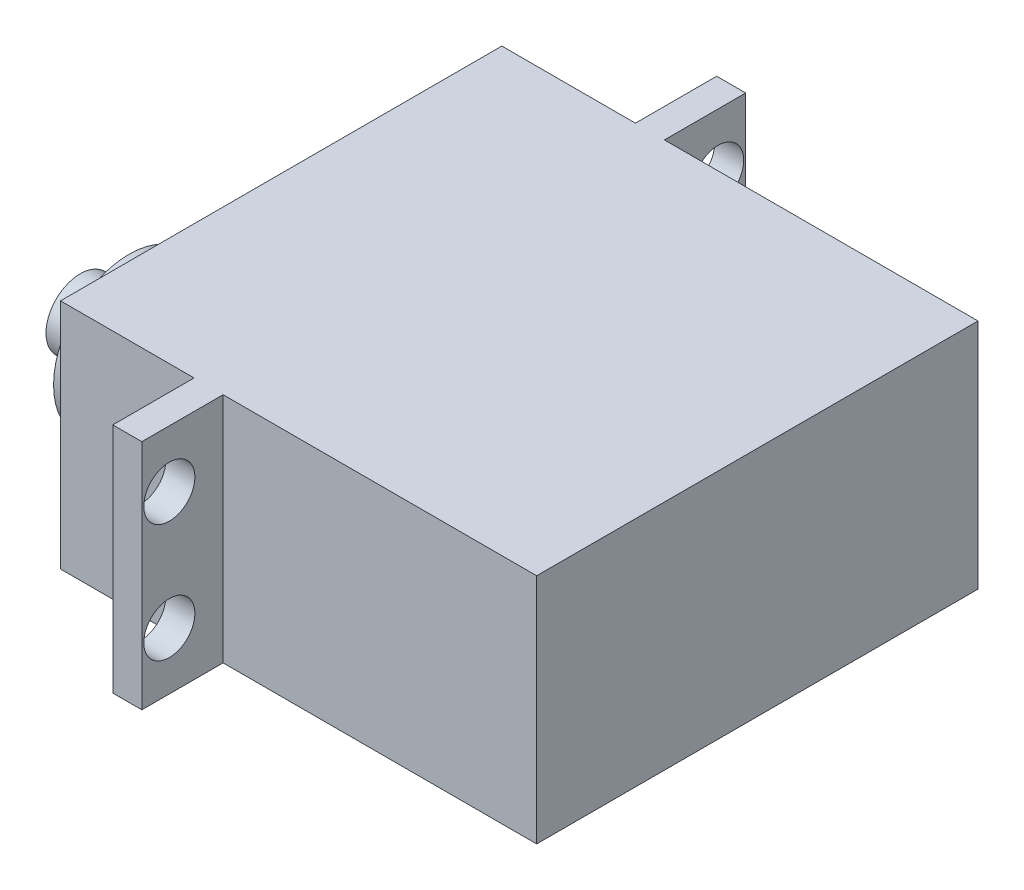
ISO-10303-21;
HEADER;
FILE_DESCRIPTION(('STEP AP214'),'2;1');
FILE_NAME('part.step','',(''),(''),'','','');
FILE_SCHEMA(('AUTOMOTIVE_DESIGN { 1 0 10303 214 1 1 1 1 }'));
ENDSEC;
DATA;
#1=APPLICATION_CONTEXT('core data for automotive mechanical design processes');
#2=APPLICATION_PROTOCOL_DEFINITION('international standard','automotive_design',2000,#1);
#3=PRODUCT_CONTEXT('',#1,'mechanical');
#4=PRODUCT('Part','Part','',(#3));
#5=PRODUCT_RELATED_PRODUCT_CATEGORY('part','',(#4));
#6=PRODUCT_DEFINITION_FORMATION('','',#4);
#7=PRODUCT_DEFINITION_CONTEXT('part definition',#1,'design');
#8=PRODUCT_DEFINITION('design','',#6,#7);
#9=PRODUCT_DEFINITION_SHAPE('','',#8);
#10=(LENGTH_UNIT() NAMED_UNIT(*) SI_UNIT(.MILLI.,.METRE.));
#11=(NAMED_UNIT(*) PLANE_ANGLE_UNIT() SI_UNIT($,.RADIAN.));
#12=(NAMED_UNIT(*) SI_UNIT($,.STERADIAN.) SOLID_ANGLE_UNIT());
#13=UNCERTAINTY_MEASURE_WITH_UNIT(LENGTH_MEASURE(1.E-05),#10,'distance_accuracy_value','');
#14=(GEOMETRIC_REPRESENTATION_CONTEXT(3) GLOBAL_UNCERTAINTY_ASSIGNED_CONTEXT((#13)) GLOBAL_UNIT_ASSIGNED_CONTEXT((#10,
#11,#12)) REPRESENTATION_CONTEXT('',''));
#15=CARTESIAN_POINT('',(0.,0.,0.));
#16=DIRECTION('',(0.,0.,1.));
#17=DIRECTION('',(1.,0.,0.));
#18=AXIS2_PLACEMENT_3D('',#15,#16,#17);
#19=CARTESIAN_POINT('',(-23.8201989820812,0.,28.3));
#20=DIRECTION('',(-1.,0.,0.));
#21=DIRECTION('',(0.,0.,1.));
#22=AXIS2_PLACEMENT_3D('',#19,#20,#21);
#23=PLANE('',#22);
#24=CARTESIAN_POINT('',(-23.8201989820812,0.,28.3));
#25=DIRECTION('',(-1.,0.,0.));
#26=DIRECTION('',(0.,0.,1.));
#27=AXIS2_PLACEMENT_3D('',#24,#25,#26);
#28=CIRCLE('',#27,6.5);
#29=CARTESIAN_POINT('',(-23.8201989820812,0.,34.8));
#30=VERTEX_POINT('',#29);
#31=EDGE_CURVE('E133',#30,#30,#28,.T.);
#32=ORIENTED_EDGE('',*,*,#31,.T.);
#33=EDGE_LOOP('',(#32));
#34=FACE_BOUND('',#33,.T.);
#35=CARTESIAN_POINT('',(-23.8201989820812,0.,28.3));
#36=DIRECTION('',(-1.,0.,0.));
#37=DIRECTION('',(0.,0.,1.));
#38=AXIS2_PLACEMENT_3D('',#35,#36,#37);
#39=CIRCLE('',#38,2.95);
#40=CARTESIAN_POINT('',(-23.8201989820812,0.,31.25));
#41=VERTEX_POINT('',#40);
#42=EDGE_CURVE('E209',#41,#41,#39,.T.);
#43=ORIENTED_EDGE('',*,*,#42,.F.);
#44=EDGE_LOOP('',(#43));
#45=FACE_BOUND('',#44,.T.);
#46=ADVANCED_FACE('F30',(#34,#45),#23,.T.);
#47=CARTESIAN_POINT('',(-20.0201989820812,9.77558057072201,38.));
#48=DIRECTION('',(1.,0.,0.));
#49=DIRECTION('',(0.,0.,-1.));
#50=AXIS2_PLACEMENT_3D('',#47,#48,#49);
#51=PLANE('',#50);
#52=DIRECTION('',(0.,-1.,0.));
#53=VECTOR('',#52,1.);
#54=CARTESIAN_POINT('',(-20.0201989820812,9.77558057072201,0.));
#55=LINE('',#54,#53);
#56=CARTESIAN_POINT('',(-20.0201989820812,9.77558057072201,0.));
#57=VERTEX_POINT('',#56);
#58=CARTESIAN_POINT('',(-20.0201989820812,-10.224419429278,0.));
#59=VERTEX_POINT('',#58);
#60=EDGE_CURVE('E170',#57,#59,#55,.T.);
#61=ORIENTED_EDGE('',*,*,#60,.T.);
#62=DIRECTION('',(0.,0.,-1.));
#63=VECTOR('',#62,1.);
#64=CARTESIAN_POINT('',(-20.0201989820812,-10.224419429278,38.));
#65=LINE('',#64,#63);
#66=CARTESIAN_POINT('',(-20.0201989820812,-10.224419429278,38.));
#67=VERTEX_POINT('',#66);
#68=EDGE_CURVE('E200',#67,#59,#65,.T.);
#69=ORIENTED_EDGE('',*,*,#68,.F.);
#70=DIRECTION('',(0.,-1.,0.));
#71=VECTOR('',#70,1.);
#72=CARTESIAN_POINT('',(-20.0201989820812,9.77558057072201,38.));
#73=LINE('',#72,#71);
#74=CARTESIAN_POINT('',(-20.0201989820812,9.77558057072201,38.));
#75=VERTEX_POINT('',#74);
#76=EDGE_CURVE('E171',#75,#67,#73,.T.);
#77=ORIENTED_EDGE('',*,*,#76,.F.);
#78=DIRECTION('',(0.,0.,-1.));
#79=VECTOR('',#78,1.);
#80=CARTESIAN_POINT('',(-20.0201989820812,9.77558057072201,38.));
#81=LINE('',#80,#79);
#82=EDGE_CURVE('E181',#75,#57,#81,.T.);
#83=ORIENTED_EDGE('',*,*,#82,.T.);
#84=EDGE_LOOP('',(#61,#69,#77,#83));
#85=FACE_BOUND('',#84,.T.);
#86=CARTESIAN_POINT('',(-20.0201989820812,0.,28.3));
#87=DIRECTION('',(1.,0.,0.));
#88=DIRECTION('',(0.,0.,-1.));
#89=AXIS2_PLACEMENT_3D('',#86,#87,#88);
#90=CIRCLE('',#89,6.5);
#91=CARTESIAN_POINT('',(-20.0201989820812,0.,21.8));
#92=VERTEX_POINT('',#91);
#93=EDGE_CURVE('E11',#92,#92,#90,.F.);
#94=ORIENTED_EDGE('',*,*,#93,.F.);
#95=EDGE_LOOP('',(#94));
#96=FACE_BOUND('',#95,.T.);
#97=ADVANCED_FACE('F32',(#85,#96),#51,.F.);
#98=CARTESIAN_POINT('',(-20.0201989820812,-10.224419429278,38.));
#99=DIRECTION('',(0.,0.,1.));
#100=DIRECTION('',(1.,0.,0.));
#101=AXIS2_PLACEMENT_3D('',#98,#99,#100);
#102=PLANE('',#101);
#103=DIRECTION('',(0.,-1.,0.));
#104=VECTOR('',#103,1.);
#105=CARTESIAN_POINT('',(-8.52019898208117,-10.224419429278,38.));
#106=LINE('',#105,#104);
#107=CARTESIAN_POINT('',(-8.52019898208118,9.77558057072201,38.));
#108=VERTEX_POINT('',#107);
#109=CARTESIAN_POINT('',(-8.52019898208118,-10.224419429278,38.));
#110=VERTEX_POINT('',#109);
#111=EDGE_CURVE('E47',#108,#110,#106,.T.);
#112=ORIENTED_EDGE('',*,*,#111,.F.);
#113=DIRECTION('',(-1.,0.,0.));
#114=VECTOR('',#113,1.);
#115=CARTESIAN_POINT('',(-20.0201989820812,9.77558057072201,38.));
#116=LINE('',#115,#114);
#117=EDGE_CURVE('E130',#108,#75,#116,.T.);
#118=ORIENTED_EDGE('',*,*,#117,.T.);
#119=ORIENTED_EDGE('',*,*,#76,.T.);
#120=DIRECTION('',(1.,0.,0.));
#121=VECTOR('',#120,1.);
#122=CARTESIAN_POINT('',(-20.0201989820812,-10.224419429278,38.));
#123=LINE('',#122,#121);
#124=EDGE_CURVE('E176',#67,#110,#123,.T.);
#125=ORIENTED_EDGE('',*,*,#124,.T.);
#126=EDGE_LOOP('',(#112,#118,#119,#125));
#127=FACE_BOUND('',#126,.T.);
#128=ADVANCED_FACE('F269',(#127),#102,.T.);
#129=CARTESIAN_POINT('',(-20.0201989820812,-10.224419429278,0.));
#130=DIRECTION('',(0.,0.,1.));
#131=DIRECTION('',(1.,0.,0.));
#132=AXIS2_PLACEMENT_3D('',#129,#130,#131);
#133=PLANE('',#132);
#134=DIRECTION('',(-1.,0.,0.));
#135=VECTOR('',#134,1.);
#136=CARTESIAN_POINT('',(-20.0201989820812,9.77558057072201,0.));
#137=LINE('',#136,#135);
#138=CARTESIAN_POINT('',(-8.52019898208118,9.77558057072201,0.));
#139=VERTEX_POINT('',#138);
#140=EDGE_CURVE('E190',#139,#57,#137,.T.);
#141=ORIENTED_EDGE('',*,*,#140,.F.);
#142=DIRECTION('',(0.,-1.,0.));
#143=VECTOR('',#142,1.);
#144=CARTESIAN_POINT('',(-8.52019898208118,-10.224419429278,0.));
#145=LINE('',#144,#143);
#146=CARTESIAN_POINT('',(-8.52019898208118,-10.224419429278,0.));
#147=VERTEX_POINT('',#146);
#148=EDGE_CURVE('E39',#139,#147,#145,.T.);
#149=ORIENTED_EDGE('',*,*,#148,.T.);
#150=DIRECTION('',(1.,0.,0.));
#151=VECTOR('',#150,1.);
#152=CARTESIAN_POINT('',(-20.0201989820812,-10.224419429278,0.));
#153=LINE('',#152,#151);
#154=EDGE_CURVE('E185',#59,#147,#153,.T.);
#155=ORIENTED_EDGE('',*,*,#154,.F.);
#156=ORIENTED_EDGE('',*,*,#60,.F.);
#157=EDGE_LOOP('',(#141,#149,#155,#156));
#158=FACE_BOUND('',#157,.T.);
#159=ADVANCED_FACE('F262',(#158),#133,.F.);
#160=CARTESIAN_POINT('',(-20.0201989820812,-10.224419429278,38.));
#161=DIRECTION('',(0.,1.,0.));
#162=DIRECTION('',(0.,0.,1.));
#163=AXIS2_PLACEMENT_3D('',#160,#161,#162);
#164=PLANE('',#163);
#165=CARTESIAN_POINT('',(-6.02019898208118,-10.224419429278,38.));
#166=VERTEX_POINT('',#165);
#167=CARTESIAN_POINT('',(20.9798010179188,-10.224419429278,38.));
#168=VERTEX_POINT('',#167);
#169=EDGE_CURVE('E174',#166,#168,#123,.T.);
#170=ORIENTED_EDGE('',*,*,#169,.F.);
#171=DIRECTION('',(0.,0.,1.));
#172=VECTOR('',#171,1.);
#173=CARTESIAN_POINT('',(-6.02019898208118,-10.224419429278,-7.));
#174=LINE('',#173,#172);
#175=CARTESIAN_POINT('',(-6.02019898208117,-10.224419429278,45.));
#176=VERTEX_POINT('',#175);
#177=EDGE_CURVE('E160',#166,#176,#174,.T.);
#178=ORIENTED_EDGE('',*,*,#177,.T.);
#179=DIRECTION('',(-1.,0.,0.));
#180=VECTOR('',#179,1.);
#181=CARTESIAN_POINT('',(-8.52019898208117,-10.224419429278,45.));
#182=LINE('',#181,#180);
#183=CARTESIAN_POINT('',(-8.52019898208117,-10.224419429278,45.));
#184=VERTEX_POINT('',#183);
#185=EDGE_CURVE('E165',#176,#184,#182,.T.);
#186=ORIENTED_EDGE('',*,*,#185,.T.);
#187=DIRECTION('',(0.,0.,-1.));
#188=VECTOR('',#187,1.);
#189=CARTESIAN_POINT('',(-8.52019898208118,-10.224419429278,-7.));
#190=LINE('',#189,#188);
#191=EDGE_CURVE('E140',#184,#110,#190,.T.);
#192=ORIENTED_EDGE('',*,*,#191,.T.);
#193=ORIENTED_EDGE('',*,*,#124,.F.);
#194=ORIENTED_EDGE('',*,*,#68,.T.);
#195=ORIENTED_EDGE('',*,*,#154,.T.);
#196=CARTESIAN_POINT('',(-8.52019898208118,-10.224419429278,-7.));
#197=VERTEX_POINT('',#196);
#198=EDGE_CURVE('E232',#147,#197,#190,.T.);
#199=ORIENTED_EDGE('',*,*,#198,.T.);
#200=DIRECTION('',(1.,0.,0.));
#201=VECTOR('',#200,1.);
#202=CARTESIAN_POINT('',(-8.52019898208118,-10.224419429278,-7.));
#203=LINE('',#202,#201);
#204=CARTESIAN_POINT('',(-6.02019898208118,-10.224419429278,-7.));
#205=VERTEX_POINT('',#204);
#206=EDGE_CURVE('E231',#197,#205,#203,.T.);
#207=ORIENTED_EDGE('',*,*,#206,.T.);
#208=CARTESIAN_POINT('',(-6.02019898208117,-10.224419429278,0.));
#209=VERTEX_POINT('',#208);
#210=EDGE_CURVE('E229',#205,#209,#174,.T.);
#211=ORIENTED_EDGE('',*,*,#210,.T.);
#212=CARTESIAN_POINT('',(20.9798010179188,-10.224419429278,0.));
#213=VERTEX_POINT('',#212);
#214=EDGE_CURVE('E184',#209,#213,#153,.T.);
#215=ORIENTED_EDGE('',*,*,#214,.T.);
#216=DIRECTION('',(0.,0.,-1.));
#217=VECTOR('',#216,1.);
#218=CARTESIAN_POINT('',(20.9798010179188,-10.224419429278,38.));
#219=LINE('',#218,#217);
#220=EDGE_CURVE('E197',#168,#213,#219,.T.);
#221=ORIENTED_EDGE('',*,*,#220,.F.);
#222=EDGE_LOOP('',(#170,#178,#186,#192,#193,#194,#195,#199,#207,#211,#215,#221));
#223=FACE_BOUND('',#222,.T.);
#224=ADVANCED_FACE('F235',(#223),#164,.F.);
#225=CARTESIAN_POINT('',(20.9798010179188,9.77558057072201,38.));
#226=DIRECTION('',(-1.,0.,0.));
#227=DIRECTION('',(0.,0.,1.));
#228=AXIS2_PLACEMENT_3D('',#225,#226,#227);
#229=PLANE('',#228);
#230=DIRECTION('',(0.,1.,0.));
#231=VECTOR('',#230,1.);
#232=CARTESIAN_POINT('',(20.9798010179188,9.77558057072201,0.));
#233=LINE('',#232,#231);
#234=CARTESIAN_POINT('',(20.9798010179188,9.77558057072201,0.));
#235=VERTEX_POINT('',#234);
#236=EDGE_CURVE('E188',#213,#235,#233,.T.);
#237=ORIENTED_EDGE('',*,*,#236,.T.);
#238=DIRECTION('',(0.,0.,-1.));
#239=VECTOR('',#238,1.);
#240=CARTESIAN_POINT('',(20.9798010179188,9.77558057072201,38.));
#241=LINE('',#240,#239);
#242=CARTESIAN_POINT('',(20.9798010179188,9.77558057072201,38.));
#243=VERTEX_POINT('',#242);
#244=EDGE_CURVE('E194',#243,#235,#241,.T.);
#245=ORIENTED_EDGE('',*,*,#244,.F.);
#246=DIRECTION('',(0.,1.,0.));
#247=VECTOR('',#246,1.);
#248=CARTESIAN_POINT('',(20.9798010179188,9.77558057072201,38.));
#249=LINE('',#248,#247);
#250=EDGE_CURVE('E178',#168,#243,#249,.T.);
#251=ORIENTED_EDGE('',*,*,#250,.F.);
#252=ORIENTED_EDGE('',*,*,#220,.T.);
#253=EDGE_LOOP('',(#237,#245,#251,#252));
#254=FACE_BOUND('',#253,.T.);
#255=ADVANCED_FACE('F256',(#254),#229,.F.);
#256=CARTESIAN_POINT('',(-20.0201989820812,9.77558057072201,38.));
#257=DIRECTION('',(0.,-1.,0.));
#258=DIRECTION('',(0.,0.,-1.));
#259=AXIS2_PLACEMENT_3D('',#256,#257,#258);
#260=PLANE('',#259);
#261=CARTESIAN_POINT('',(-6.02019898208118,9.77558057072201,0.));
#262=VERTEX_POINT('',#261);
#263=EDGE_CURVE('E175',#235,#262,#137,.T.);
#264=ORIENTED_EDGE('',*,*,#263,.T.);
#265=DIRECTION('',(0.,0.,-1.));
#266=VECTOR('',#265,1.);
#267=CARTESIAN_POINT('',(-6.02019898208118,9.77558057072201,-7.));
#268=LINE('',#267,#266);
#269=CARTESIAN_POINT('',(-6.02019898208118,9.77558057072201,-7.));
#270=VERTEX_POINT('',#269);
#271=EDGE_CURVE('E149',#262,#270,#268,.T.);
#272=ORIENTED_EDGE('',*,*,#271,.T.);
#273=DIRECTION('',(-1.,0.,0.));
#274=VECTOR('',#273,1.);
#275=CARTESIAN_POINT('',(-8.52019898208118,9.77558057072201,-7.));
#276=LINE('',#275,#274);
#277=CARTESIAN_POINT('',(-8.52019898208118,9.77558057072201,-7.));
#278=VERTEX_POINT('',#277);
#279=EDGE_CURVE('E144',#270,#278,#276,.T.);
#280=ORIENTED_EDGE('',*,*,#279,.T.);
#281=DIRECTION('',(0.,0.,1.));
#282=VECTOR('',#281,1.);
#283=CARTESIAN_POINT('',(-8.52019898208118,9.77558057072201,-7.));
#284=LINE('',#283,#282);
#285=EDGE_CURVE('E132',#278,#139,#284,.T.);
#286=ORIENTED_EDGE('',*,*,#285,.T.);
#287=ORIENTED_EDGE('',*,*,#140,.T.);
#288=ORIENTED_EDGE('',*,*,#82,.F.);
#289=ORIENTED_EDGE('',*,*,#117,.F.);
#290=CARTESIAN_POINT('',(-8.52019898208117,9.77558057072201,45.));
#291=VERTEX_POINT('',#290);
#292=EDGE_CURVE('E122',#108,#291,#284,.T.);
#293=ORIENTED_EDGE('',*,*,#292,.T.);
#294=DIRECTION('',(1.,0.,0.));
#295=VECTOR('',#294,1.);
#296=CARTESIAN_POINT('',(-8.52019898208117,9.77558057072201,45.));
#297=LINE('',#296,#295);
#298=CARTESIAN_POINT('',(-6.02019898208117,9.77558057072201,45.));
#299=VERTEX_POINT('',#298);
#300=EDGE_CURVE('E128',#291,#299,#297,.T.);
#301=ORIENTED_EDGE('',*,*,#300,.T.);
#302=CARTESIAN_POINT('',(-6.02019898208117,9.77558057072201,38.));
#303=VERTEX_POINT('',#302);
#304=EDGE_CURVE('E151',#299,#303,#268,.T.);
#305=ORIENTED_EDGE('',*,*,#304,.T.);
#306=EDGE_CURVE('E55',#243,#303,#116,.T.);
#307=ORIENTED_EDGE('',*,*,#306,.F.);
#308=ORIENTED_EDGE('',*,*,#244,.T.);
#309=EDGE_LOOP('',(#264,#272,#280,#286,#287,#288,#289,#293,#301,#305,#307,#308));
#310=FACE_BOUND('',#309,.T.);
#311=ADVANCED_FACE('F125',(#310),#260,.F.);
#312=DIRECTION('',(0.,1.,0.));
#313=VECTOR('',#312,1.);
#314=CARTESIAN_POINT('',(-6.02019898208117,-10.224419429278,38.));
#315=LINE('',#314,#313);
#316=EDGE_CURVE('E167',#166,#303,#315,.T.);
#317=ORIENTED_EDGE('',*,*,#316,.F.);
#318=ORIENTED_EDGE('',*,*,#169,.T.);
#319=ORIENTED_EDGE('',*,*,#250,.T.);
#320=ORIENTED_EDGE('',*,*,#306,.T.);
#321=EDGE_LOOP('',(#317,#318,#319,#320));
#322=FACE_BOUND('',#321,.T.);
#323=ADVANCED_FACE('F260',(#322),#102,.T.);
#324=ORIENTED_EDGE('',*,*,#214,.F.);
#325=DIRECTION('',(0.,1.,0.));
#326=VECTOR('',#325,1.);
#327=CARTESIAN_POINT('',(-6.02019898208118,-10.224419429278,0.));
#328=LINE('',#327,#326);
#329=EDGE_CURVE('E203',#209,#262,#328,.T.);
#330=ORIENTED_EDGE('',*,*,#329,.T.);
#331=ORIENTED_EDGE('',*,*,#263,.F.);
#332=ORIENTED_EDGE('',*,*,#236,.F.);
#333=EDGE_LOOP('',(#324,#330,#331,#332));
#334=FACE_BOUND('',#333,.T.);
#335=ADVANCED_FACE('F258',(#334),#133,.F.);
#336=CARTESIAN_POINT('',(-8.52019898208118,-62.2844808967792,-7.));
#337=DIRECTION('',(0.,0.,-1.));
#338=DIRECTION('',(-1.,0.,0.));
#339=AXIS2_PLACEMENT_3D('',#336,#337,#338);
#340=PLANE('',#339);
#341=ORIENTED_EDGE('',*,*,#206,.F.);
#342=DIRECTION('',(0.,1.,0.));
#343=VECTOR('',#342,1.);
#344=CARTESIAN_POINT('',(-8.52019898208118,-62.2844808967792,-7.));
#345=LINE('',#344,#343);
#346=EDGE_CURVE('E158',#197,#278,#345,.T.);
#347=ORIENTED_EDGE('',*,*,#346,.T.);
#348=ORIENTED_EDGE('',*,*,#279,.F.);
#349=DIRECTION('',(0.,1.,0.));
#350=VECTOR('',#349,1.);
#351=CARTESIAN_POINT('',(-6.02019898208118,-62.2844808967792,-7.));
#352=LINE('',#351,#350);
#353=EDGE_CURVE('E161',#205,#270,#352,.T.);
#354=ORIENTED_EDGE('',*,*,#353,.F.);
#355=EDGE_LOOP('',(#341,#347,#348,#354));
#356=FACE_BOUND('',#355,.T.);
#357=ADVANCED_FACE('F241',(#356),#340,.T.);
#358=CARTESIAN_POINT('',(-6.02019898208118,-62.2844808967792,-7.));
#359=DIRECTION('',(1.,0.,0.));
#360=DIRECTION('',(0.,0.,-1.));
#361=AXIS2_PLACEMENT_3D('',#358,#359,#360);
#362=PLANE('',#361);
#363=CARTESIAN_POINT('',(-6.02019898208118,4.86058057072201,-4.63));
#364=DIRECTION('',(1.,0.,0.));
#365=DIRECTION('',(0.,0.,-1.));
#366=AXIS2_PLACEMENT_3D('',#363,#364,#365);
#367=CIRCLE('',#366,2.19999999999999);
#368=CARTESIAN_POINT('',(-6.02019898208118,4.86058057072201,-6.82999999999998));
#369=VERTEX_POINT('',#368);
#370=EDGE_CURVE('E311',#369,#369,#367,.T.);
#371=ORIENTED_EDGE('',*,*,#370,.F.);
#372=EDGE_LOOP('',(#371));
#373=FACE_BOUND('',#372,.T.);
#374=CARTESIAN_POINT('',(-6.02019898208118,-5.30941942927799,-4.63));
#375=DIRECTION('',(1.,0.,0.));
#376=DIRECTION('',(0.,0.,-1.));
#377=AXIS2_PLACEMENT_3D('',#374,#375,#376);
#378=CIRCLE('',#377,2.19999999999999);
#379=CARTESIAN_POINT('',(-6.02019898208118,-5.30941942927799,-6.82999999999998));
#380=VERTEX_POINT('',#379);
#381=EDGE_CURVE('E305',#380,#380,#378,.T.);
#382=ORIENTED_EDGE('',*,*,#381,.F.);
#383=EDGE_LOOP('',(#382));
#384=FACE_BOUND('',#383,.T.);
#385=ORIENTED_EDGE('',*,*,#329,.F.);
#386=ORIENTED_EDGE('',*,*,#210,.F.);
#387=ORIENTED_EDGE('',*,*,#353,.T.);
#388=ORIENTED_EDGE('',*,*,#271,.F.);
#389=EDGE_LOOP('',(#385,#386,#387,#388));
#390=FACE_BOUND('',#389,.T.);
#391=ADVANCED_FACE('F249',(#373,#384,#390),#362,.T.);
#392=CARTESIAN_POINT('',(-8.52019898208118,-62.2844808967792,-7.));
#393=DIRECTION('',(-1.,0.,0.));
#394=DIRECTION('',(0.,0.,1.));
#395=AXIS2_PLACEMENT_3D('',#392,#393,#394);
#396=PLANE('',#395);
#397=CARTESIAN_POINT('',(-8.52019898208118,4.86058057072201,-4.63));
#398=DIRECTION('',(-1.,0.,0.));
#399=DIRECTION('',(0.,0.,1.));
#400=AXIS2_PLACEMENT_3D('',#397,#398,#399);
#401=CIRCLE('',#400,2.19999999999999);
#402=CARTESIAN_POINT('',(-8.52019898208118,4.86058057072201,-2.43000000000001));
#403=VERTEX_POINT('',#402);
#404=EDGE_CURVE('E316',#403,#403,#401,.T.);
#405=ORIENTED_EDGE('',*,*,#404,.F.);
#406=EDGE_LOOP('',(#405));
#407=FACE_BOUND('',#406,.T.);
#408=CARTESIAN_POINT('',(-8.52019898208118,-5.30941942927799,-4.63));
#409=DIRECTION('',(-1.,0.,0.));
#410=DIRECTION('',(0.,0.,1.));
#411=AXIS2_PLACEMENT_3D('',#408,#409,#410);
#412=CIRCLE('',#411,2.19999999999999);
#413=CARTESIAN_POINT('',(-8.52019898208118,-5.30941942927799,-2.43000000000001));
#414=VERTEX_POINT('',#413);
#415=EDGE_CURVE('E307',#414,#414,#412,.T.);
#416=ORIENTED_EDGE('',*,*,#415,.F.);
#417=EDGE_LOOP('',(#416));
#418=FACE_BOUND('',#417,.T.);
#419=ORIENTED_EDGE('',*,*,#148,.F.);
#420=ORIENTED_EDGE('',*,*,#285,.F.);
#421=ORIENTED_EDGE('',*,*,#346,.F.);
#422=ORIENTED_EDGE('',*,*,#198,.F.);
#423=EDGE_LOOP('',(#419,#420,#421,#422));
#424=FACE_BOUND('',#423,.T.);
#425=ADVANCED_FACE('F244',(#407,#418,#424),#396,.T.);
#426=CARTESIAN_POINT('',(-8.52019898208118,4.86058057072201,42.63));
#427=DIRECTION('',(-1.,0.,0.));
#428=DIRECTION('',(0.,0.,1.));
#429=AXIS2_PLACEMENT_3D('',#426,#427,#428);
#430=CIRCLE('',#429,2.19999999999999);
#431=CARTESIAN_POINT('',(-8.52019898208118,4.86058057072201,44.83));
#432=VERTEX_POINT('',#431);
#433=EDGE_CURVE('E221',#432,#432,#430,.T.);
#434=ORIENTED_EDGE('',*,*,#433,.F.);
#435=EDGE_LOOP('',(#434));
#436=FACE_BOUND('',#435,.T.);
#437=CARTESIAN_POINT('',(-8.52019898208118,-5.30941942927799,42.63));
#438=DIRECTION('',(-1.,0.,0.));
#439=DIRECTION('',(0.,0.,1.));
#440=AXIS2_PLACEMENT_3D('',#437,#438,#439);
#441=CIRCLE('',#440,2.19999999999999);
#442=CARTESIAN_POINT('',(-8.52019898208118,-5.30941942927799,44.83));
#443=VERTEX_POINT('',#442);
#444=EDGE_CURVE('E210',#443,#443,#441,.T.);
#445=ORIENTED_EDGE('',*,*,#444,.F.);
#446=EDGE_LOOP('',(#445));
#447=FACE_BOUND('',#446,.T.);
#448=ORIENTED_EDGE('',*,*,#292,.F.);
#449=ORIENTED_EDGE('',*,*,#111,.T.);
#450=ORIENTED_EDGE('',*,*,#191,.F.);
#451=DIRECTION('',(0.,1.,0.));
#452=VECTOR('',#451,1.);
#453=CARTESIAN_POINT('',(-8.52019898208117,-62.2844808967792,45.));
#454=LINE('',#453,#452);
#455=EDGE_CURVE('E137',#184,#291,#454,.T.);
#456=ORIENTED_EDGE('',*,*,#455,.T.);
#457=EDGE_LOOP('',(#448,#449,#450,#456));
#458=FACE_BOUND('',#457,.T.);
#459=ADVANCED_FACE('F138',(#436,#447,#458),#396,.T.);
#460=CARTESIAN_POINT('',(-6.02019898208117,4.86058057072201,42.63));
#461=DIRECTION('',(1.,0.,0.));
#462=DIRECTION('',(0.,0.,-1.));
#463=AXIS2_PLACEMENT_3D('',#460,#461,#462);
#464=CIRCLE('',#463,2.19999999999999);
#465=CARTESIAN_POINT('',(-6.02019898208117,4.86058057072201,40.43));
#466=VERTEX_POINT('',#465);
#467=EDGE_CURVE('E34',#466,#466,#464,.T.);
#468=ORIENTED_EDGE('',*,*,#467,.F.);
#469=EDGE_LOOP('',(#468));
#470=FACE_BOUND('',#469,.T.);
#471=CARTESIAN_POINT('',(-6.02019898208117,-5.30941942927799,42.63));
#472=DIRECTION('',(1.,0.,0.));
#473=DIRECTION('',(0.,0.,-1.));
#474=AXIS2_PLACEMENT_3D('',#471,#472,#473);
#475=CIRCLE('',#474,2.19999999999999);
#476=CARTESIAN_POINT('',(-6.02019898208117,-5.30941942927799,40.43));
#477=VERTEX_POINT('',#476);
#478=EDGE_CURVE('E207',#477,#477,#475,.T.);
#479=ORIENTED_EDGE('',*,*,#478,.F.);
#480=EDGE_LOOP('',(#479));
#481=FACE_BOUND('',#480,.T.);
#482=ORIENTED_EDGE('',*,*,#177,.F.);
#483=ORIENTED_EDGE('',*,*,#316,.T.);
#484=ORIENTED_EDGE('',*,*,#304,.F.);
#485=DIRECTION('',(0.,1.,0.));
#486=VECTOR('',#485,1.);
#487=CARTESIAN_POINT('',(-6.02019898208117,-62.2844808967792,45.));
#488=LINE('',#487,#486);
#489=EDGE_CURVE('E143',#176,#299,#488,.T.);
#490=ORIENTED_EDGE('',*,*,#489,.F.);
#491=EDGE_LOOP('',(#482,#483,#484,#490));
#492=FACE_BOUND('',#491,.T.);
#493=ADVANCED_FACE('F289',(#470,#481,#492),#362,.T.);
#494=CARTESIAN_POINT('',(-8.52019898208117,-62.2844808967792,45.));
#495=DIRECTION('',(0.,0.,1.));
#496=DIRECTION('',(1.,0.,0.));
#497=AXIS2_PLACEMENT_3D('',#494,#495,#496);
#498=PLANE('',#497);
#499=ORIENTED_EDGE('',*,*,#185,.F.);
#500=ORIENTED_EDGE('',*,*,#489,.T.);
#501=ORIENTED_EDGE('',*,*,#300,.F.);
#502=ORIENTED_EDGE('',*,*,#455,.F.);
#503=EDGE_LOOP('',(#499,#500,#501,#502));
#504=FACE_BOUND('',#503,.T.);
#505=ADVANCED_FACE('F146',(#504),#498,.T.);
#506=CARTESIAN_POINT('',(-23.8201989820812,0.,28.3));
#507=DIRECTION('',(1.,0.,0.));
#508=DIRECTION('',(0.,0.,-1.));
#509=AXIS2_PLACEMENT_3D('',#506,#507,#508);
#510=CYLINDRICAL_SURFACE('',#509,6.5);
#511=ORIENTED_EDGE('',*,*,#31,.F.);
#512=EDGE_LOOP('',(#511));
#513=FACE_BOUND('',#512,.T.);
#514=ORIENTED_EDGE('',*,*,#93,.T.);
#515=EDGE_LOOP('',(#514));
#516=FACE_BOUND('',#515,.T.);
#517=ADVANCED_FACE('F285',(#513,#516),#510,.T.);
#518=CARTESIAN_POINT('',(-28.0201989820812,0.,28.3));
#519=DIRECTION('',(1.,0.,0.));
#520=DIRECTION('',(0.,0.,-1.));
#521=AXIS2_PLACEMENT_3D('',#518,#519,#520);
#522=CYLINDRICAL_SURFACE('',#521,2.95);
#523=CARTESIAN_POINT('',(-28.0201989820812,0.,28.3));
#524=DIRECTION('',(-1.,0.,0.));
#525=DIRECTION('',(0.,0.,1.));
#526=AXIS2_PLACEMENT_3D('',#523,#524,#525);
#527=CIRCLE('',#526,2.95);
#528=CARTESIAN_POINT('',(-28.0201989820812,0.,31.25));
#529=VERTEX_POINT('',#528);
#530=EDGE_CURVE('E214',#529,#529,#527,.T.);
#531=ORIENTED_EDGE('',*,*,#530,.F.);
#532=EDGE_LOOP('',(#531));
#533=FACE_BOUND('',#532,.T.);
#534=ORIENTED_EDGE('',*,*,#42,.T.);
#535=EDGE_LOOP('',(#534));
#536=FACE_BOUND('',#535,.T.);
#537=ADVANCED_FACE('F283',(#533,#536),#522,.T.);
#538=CARTESIAN_POINT('',(-28.0201989820812,0.,28.3));
#539=DIRECTION('',(-1.,0.,0.));
#540=DIRECTION('',(0.,0.,1.));
#541=AXIS2_PLACEMENT_3D('',#538,#539,#540);
#542=PLANE('',#541);
#543=ORIENTED_EDGE('',*,*,#530,.T.);
#544=EDGE_LOOP('',(#543));
#545=FACE_BOUND('',#544,.T.);
#546=ADVANCED_FACE('F339',(#545),#542,.T.);
#547=CARTESIAN_POINT('',(-8.52019898208118,-5.30941942927799,42.63));
#548=DIRECTION('',(-1.,0.,0.));
#549=DIRECTION('',(0.,0.,1.));
#550=AXIS2_PLACEMENT_3D('',#547,#548,#549);
#551=CYLINDRICAL_SURFACE('',#550,2.19999999999999);
#552=ORIENTED_EDGE('',*,*,#478,.T.);
#553=EDGE_LOOP('',(#552));
#554=FACE_BOUND('',#553,.T.);
#555=ORIENTED_EDGE('',*,*,#444,.T.);
#556=EDGE_LOOP('',(#555));
#557=FACE_BOUND('',#556,.T.);
#558=ADVANCED_FACE('F334',(#554,#557),#551,.F.);
#559=CARTESIAN_POINT('',(-8.52019898208118,4.86058057072201,42.63));
#560=DIRECTION('',(-1.,0.,0.));
#561=DIRECTION('',(0.,0.,1.));
#562=AXIS2_PLACEMENT_3D('',#559,#560,#561);
#563=CYLINDRICAL_SURFACE('',#562,2.19999999999999);
#564=ORIENTED_EDGE('',*,*,#467,.T.);
#565=EDGE_LOOP('',(#564));
#566=FACE_BOUND('',#565,.T.);
#567=ORIENTED_EDGE('',*,*,#433,.T.);
#568=EDGE_LOOP('',(#567));
#569=FACE_BOUND('',#568,.T.);
#570=ADVANCED_FACE('F326',(#566,#569),#563,.F.);
#571=CARTESIAN_POINT('',(-8.52019898208118,-5.30941942927799,-4.63));
#572=DIRECTION('',(-1.,0.,0.));
#573=DIRECTION('',(0.,0.,1.));
#574=AXIS2_PLACEMENT_3D('',#571,#572,#573);
#575=CYLINDRICAL_SURFACE('',#574,2.19999999999999);
#576=ORIENTED_EDGE('',*,*,#381,.T.);
#577=EDGE_LOOP('',(#576));
#578=FACE_BOUND('',#577,.T.);
#579=ORIENTED_EDGE('',*,*,#415,.T.);
#580=EDGE_LOOP('',(#579));
#581=FACE_BOUND('',#580,.T.);
#582=ADVANCED_FACE('F324',(#578,#581),#575,.F.);
#583=CARTESIAN_POINT('',(-8.52019898208118,4.86058057072201,-4.63));
#584=DIRECTION('',(-1.,0.,0.));
#585=DIRECTION('',(0.,0.,1.));
#586=AXIS2_PLACEMENT_3D('',#583,#584,#585);
#587=CYLINDRICAL_SURFACE('',#586,2.19999999999999);
#588=ORIENTED_EDGE('',*,*,#370,.T.);
#589=EDGE_LOOP('',(#588));
#590=FACE_BOUND('',#589,.T.);
#591=ORIENTED_EDGE('',*,*,#404,.T.);
#592=EDGE_LOOP('',(#591));
#593=FACE_BOUND('',#592,.T.);
#594=ADVANCED_FACE('F320',(#590,#593),#587,.F.);
#595=CLOSED_SHELL('',(#46,#97,#128,#159,#224,#255,#311,#323,#335,#357,#391,#425,#459,#493,#505,
#517,#537,#546,#558,#570,#582,#594));
#596=MANIFOLD_SOLID_BREP('B2',#595);
#597=ADVANCED_BREP_SHAPE_REPRESENTATION('',(#18,#596),#14);
#598=SHAPE_DEFINITION_REPRESENTATION(#9,#597);
ENDSEC;
END-ISO-10303-21;
